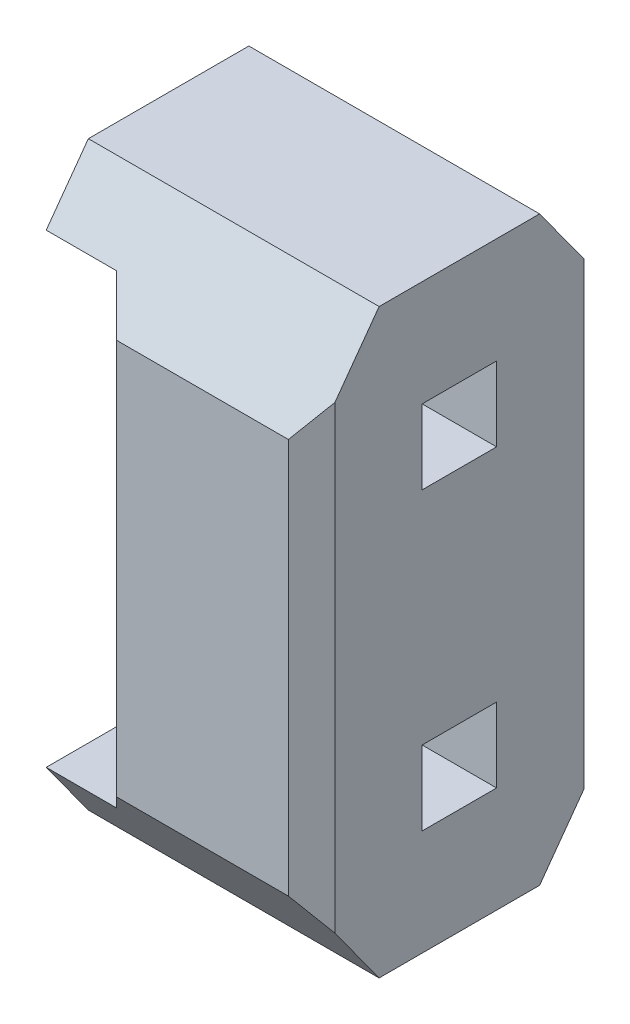
ISO-10303-21;
HEADER;
FILE_DESCRIPTION(('STEP AP214'),'2;1');
FILE_NAME('part.step','',(''),(''),'','','');
FILE_SCHEMA(('AUTOMOTIVE_DESIGN { 1 0 10303 214 1 1 1 1 }'));
ENDSEC;
DATA;
#1=APPLICATION_CONTEXT('core data for automotive mechanical design processes');
#2=APPLICATION_PROTOCOL_DEFINITION('international standard','automotive_design',2000,#1);
#3=PRODUCT_CONTEXT('',#1,'mechanical');
#4=PRODUCT('Part','Part','',(#3));
#5=PRODUCT_RELATED_PRODUCT_CATEGORY('part','',(#4));
#6=PRODUCT_DEFINITION_FORMATION('','',#4);
#7=PRODUCT_DEFINITION_CONTEXT('part definition',#1,'design');
#8=PRODUCT_DEFINITION('design','',#6,#7);
#9=PRODUCT_DEFINITION_SHAPE('','',#8);
#10=(LENGTH_UNIT() NAMED_UNIT(*) SI_UNIT(.MILLI.,.METRE.));
#11=(NAMED_UNIT(*) PLANE_ANGLE_UNIT() SI_UNIT($,.RADIAN.));
#12=(NAMED_UNIT(*) SI_UNIT($,.STERADIAN.) SOLID_ANGLE_UNIT());
#13=UNCERTAINTY_MEASURE_WITH_UNIT(LENGTH_MEASURE(1.E-05),#10,'distance_accuracy_value','');
#14=(GEOMETRIC_REPRESENTATION_CONTEXT(3) GLOBAL_UNCERTAINTY_ASSIGNED_CONTEXT((#13)) GLOBAL_UNIT_ASSIGNED_CONTEXT((#10,
#11,#12)) REPRESENTATION_CONTEXT('',''));
#15=CARTESIAN_POINT('',(0.,0.,0.));
#16=DIRECTION('',(0.,0.,1.));
#17=DIRECTION('',(1.,0.,0.));
#18=AXIS2_PLACEMENT_3D('',#15,#16,#17);
#19=CARTESIAN_POINT('',(1.25,4.6,-33.31));
#20=DIRECTION('',(0.,0.586967571460905,0.809610443394407));
#21=DIRECTION('',(0.,-0.809610443394407,0.586967571460905));
#22=AXIS2_PLACEMENT_3D('',#19,#20,#21);
#23=PLANE('',#22);
#24=DIRECTION('',(1.,0.,0.));
#25=VECTOR('',#24,1.);
#26=CARTESIAN_POINT('',(1.25,4.49999999999999,-33.2375));
#27=LINE('',#26,#25);
#28=CARTESIAN_POINT('',(0.,4.5,-33.2375));
#29=VERTEX_POINT('',#28);
#30=CARTESIAN_POINT('',(0.602500000000326,4.5,-33.2375000000001));
#31=VERTEX_POINT('',#30);
#32=EDGE_CURVE('E199',#29,#31,#27,.T.);
#33=ORIENTED_EDGE('',*,*,#32,.T.);
#34=DIRECTION('',(0.506207656348698,-0.698217457033983,0.506207656349602));
#35=VECTOR('',#34,1.);
#36=CARTESIAN_POINT('',(0.6025000000002,4.49999999999999,-33.2375));
#37=LINE('',#36,#35);
#38=CARTESIAN_POINT('',(0.819999999999672,4.19999999999999,-33.0199999999999));
#39=VERTEX_POINT('',#38);
#40=EDGE_CURVE('E197',#31,#39,#37,.T.);
#41=ORIENTED_EDGE('',*,*,#40,.T.);
#42=DIRECTION('',(1.,0.,0.));
#43=VECTOR('',#42,1.);
#44=CARTESIAN_POINT('',(1.25,4.19999999999999,-33.02));
#45=LINE('',#44,#43);
#46=CARTESIAN_POINT('',(2.30000000000012,4.19999999999999,-33.0199999999999));
#47=VERTEX_POINT('',#46);
#48=EDGE_CURVE('E20',#39,#47,#45,.T.);
#49=ORIENTED_EDGE('',*,*,#48,.T.);
#50=DIRECTION('',(0.506207656348956,0.698217457033859,-0.506207656349515));
#51=VECTOR('',#50,1.);
#52=CARTESIAN_POINT('',(2.3,4.19999999999999,-33.02));
#53=LINE('',#52,#51);
#54=CARTESIAN_POINT('',(2.49999999999988,4.47586206896591,-33.2200000000002));
#55=VERTEX_POINT('',#54);
#56=EDGE_CURVE('E181',#47,#55,#53,.T.);
#57=ORIENTED_EDGE('',*,*,#56,.T.);
#58=DIRECTION('',(0.,-0.809610443394407,0.586967571460905));
#59=VECTOR('',#58,1.);
#60=CARTESIAN_POINT('',(2.5,4.6,-33.31));
#61=LINE('',#60,#59);
#62=CARTESIAN_POINT('',(2.5,5.,-33.6));
#63=VERTEX_POINT('',#62);
#64=EDGE_CURVE('E188',#55,#63,#61,.F.);
#65=ORIENTED_EDGE('',*,*,#64,.T.);
#66=DIRECTION('',(1.,0.,0.));
#67=VECTOR('',#66,1.);
#68=CARTESIAN_POINT('',(1.25,5.,-33.6));
#69=LINE('',#68,#67);
#70=CARTESIAN_POINT('',(0.,5.,-33.6));
#71=VERTEX_POINT('',#70);
#72=EDGE_CURVE('E215',#71,#63,#69,.T.);
#73=ORIENTED_EDGE('',*,*,#72,.F.);
#74=DIRECTION('',(0.,-0.809610443394407,0.586967571460905));
#75=VECTOR('',#74,1.);
#76=CARTESIAN_POINT('',(0.,4.6,-33.31));
#77=LINE('',#76,#75);
#78=EDGE_CURVE('E207',#71,#29,#77,.T.);
#79=ORIENTED_EDGE('',*,*,#78,.T.);
#80=EDGE_LOOP('',(#33,#41,#49,#57,#65,#73,#79));
#81=FACE_BOUND('',#80,.T.);
#82=ADVANCED_FACE('F17',(#81),#23,.T.);
#83=CARTESIAN_POINT('',(1.25,4.6,-35.27));
#84=DIRECTION('',(0.,-0.586967571460905,0.809610443394407));
#85=DIRECTION('',(0.,-0.809610443394407,-0.586967571460905));
#86=AXIS2_PLACEMENT_3D('',#83,#84,#85);
#87=PLANE('',#86);
#88=DIRECTION('',(0.,-0.809610443394407,-0.586967571460905));
#89=VECTOR('',#88,1.);
#90=CARTESIAN_POINT('',(0.,4.6,-35.27));
#91=LINE('',#90,#89);
#92=CARTESIAN_POINT('',(0.,5.00000000000001,-34.98));
#93=VERTEX_POINT('',#92);
#94=CARTESIAN_POINT('',(0.,4.5,-35.3425));
#95=VERTEX_POINT('',#94);
#96=EDGE_CURVE('E263',#93,#95,#91,.T.);
#97=ORIENTED_EDGE('',*,*,#96,.F.);
#98=DIRECTION('',(1.,0.,0.));
#99=VECTOR('',#98,1.);
#100=CARTESIAN_POINT('',(1.25,5.,-34.98));
#101=LINE('',#100,#99);
#102=CARTESIAN_POINT('',(2.5,5.,-34.98));
#103=VERTEX_POINT('',#102);
#104=EDGE_CURVE('E227',#103,#93,#101,.F.);
#105=ORIENTED_EDGE('',*,*,#104,.F.);
#106=DIRECTION('',(0.,-0.809610443394407,-0.586967571460905));
#107=VECTOR('',#106,1.);
#108=CARTESIAN_POINT('',(2.5,4.6,-35.27));
#109=LINE('',#108,#107);
#110=CARTESIAN_POINT('',(2.49999999999988,4.47586206896592,-35.3599999999998));
#111=VERTEX_POINT('',#110);
#112=EDGE_CURVE('E223',#111,#103,#109,.F.);
#113=ORIENTED_EDGE('',*,*,#112,.F.);
#114=DIRECTION('',(0.506207656348957,0.698217457033858,0.506207656349515));
#115=VECTOR('',#114,1.);
#116=CARTESIAN_POINT('',(2.3,4.19999999999999,-35.56));
#117=LINE('',#116,#115);
#118=CARTESIAN_POINT('',(2.30000000000012,4.2,-35.5600000000001));
#119=VERTEX_POINT('',#118);
#120=EDGE_CURVE('E266',#119,#111,#117,.T.);
#121=ORIENTED_EDGE('',*,*,#120,.F.);
#122=DIRECTION('',(1.,0.,0.));
#123=VECTOR('',#122,1.);
#124=CARTESIAN_POINT('',(1.25,4.19999999999999,-35.56));
#125=LINE('',#124,#123);
#126=CARTESIAN_POINT('',(0.819999999999671,4.2,-35.5600000000001));
#127=VERTEX_POINT('',#126);
#128=EDGE_CURVE('E205',#127,#119,#125,.T.);
#129=ORIENTED_EDGE('',*,*,#128,.F.);
#130=DIRECTION('',(0.506207656348697,-0.698217457033984,-0.506207656349602));
#131=VECTOR('',#130,1.);
#132=CARTESIAN_POINT('',(0.6025000000002,4.5,-35.3425));
#133=LINE('',#132,#131);
#134=CARTESIAN_POINT('',(0.602500000000324,4.5,-35.3424999999999));
#135=VERTEX_POINT('',#134);
#136=EDGE_CURVE('E203',#135,#127,#133,.T.);
#137=ORIENTED_EDGE('',*,*,#136,.F.);
#138=DIRECTION('',(1.,0.,0.));
#139=VECTOR('',#138,1.);
#140=CARTESIAN_POINT('',(1.25,4.5,-35.3425));
#141=LINE('',#140,#139);
#142=EDGE_CURVE('E261',#95,#135,#141,.T.);
#143=ORIENTED_EDGE('',*,*,#142,.F.);
#144=EDGE_LOOP('',(#97,#105,#113,#121,#129,#137,#143));
#145=FACE_BOUND('',#144,.T.);
#146=ADVANCED_FACE('F285',(#145),#87,.F.);
#147=CARTESIAN_POINT('',(1.25,0.4,-35.27));
#148=DIRECTION('',(0.,0.586967571460905,0.809610443394407));
#149=DIRECTION('',(0.,-0.809610443394407,0.586967571460905));
#150=AXIS2_PLACEMENT_3D('',#147,#148,#149);
#151=PLANE('',#150);
#152=DIRECTION('',(-0.506207656349409,0.698217457033648,-0.506207656349353));
#153=VECTOR('',#152,1.);
#154=CARTESIAN_POINT('',(2.5,0.524137931034498,-35.36));
#155=LINE('',#154,#153);
#156=CARTESIAN_POINT('',(2.49999999999988,0.524137931034499,-35.3599999999999));
#157=VERTEX_POINT('',#156);
#158=CARTESIAN_POINT('',(2.30000000000012,0.800000000000004,-35.5600000000001));
#159=VERTEX_POINT('',#158);
#160=EDGE_CURVE('E251',#157,#159,#155,.T.);
#161=ORIENTED_EDGE('',*,*,#160,.F.);
#162=DIRECTION('',(0.,-0.809610443394407,0.586967571460905));
#163=VECTOR('',#162,1.);
#164=CARTESIAN_POINT('',(2.5,0.4,-35.27));
#165=LINE('',#164,#163);
#166=CARTESIAN_POINT('',(2.5,0.,-34.98));
#167=VERTEX_POINT('',#166);
#168=EDGE_CURVE('E253',#167,#157,#165,.F.);
#169=ORIENTED_EDGE('',*,*,#168,.F.);
#170=DIRECTION('',(1.,0.,0.));
#171=VECTOR('',#170,1.);
#172=CARTESIAN_POINT('',(1.25,0.,-34.98));
#173=LINE('',#172,#171);
#174=CARTESIAN_POINT('',(0.,0.,-34.98));
#175=VERTEX_POINT('',#174);
#176=EDGE_CURVE('E288',#167,#175,#173,.F.);
#177=ORIENTED_EDGE('',*,*,#176,.T.);
#178=DIRECTION('',(0.,-0.809610443394407,0.586967571460905));
#179=VECTOR('',#178,1.);
#180=CARTESIAN_POINT('',(0.,0.4,-35.27));
#181=LINE('',#180,#179);
#182=CARTESIAN_POINT('',(0.,0.5,-35.3425));
#183=VERTEX_POINT('',#182);
#184=EDGE_CURVE('E255',#183,#175,#181,.T.);
#185=ORIENTED_EDGE('',*,*,#184,.F.);
#186=DIRECTION('',(1.,0.,0.));
#187=VECTOR('',#186,1.);
#188=CARTESIAN_POINT('',(1.25,0.500000000000001,-35.3425));
#189=LINE('',#188,#187);
#190=CARTESIAN_POINT('',(0.602500000000324,0.5,-35.3424999999999));
#191=VERTEX_POINT('',#190);
#192=EDGE_CURVE('E257',#191,#183,#189,.F.);
#193=ORIENTED_EDGE('',*,*,#192,.F.);
#194=DIRECTION('',(-0.506207656348696,-0.698217457033985,0.506207656349601));
#195=VECTOR('',#194,1.);
#196=CARTESIAN_POINT('',(0.8199999999998,0.800000000000008,-35.56));
#197=LINE('',#196,#195);
#198=CARTESIAN_POINT('',(0.819999999999671,0.800000000000004,-35.5600000000001));
#199=VERTEX_POINT('',#198);
#200=EDGE_CURVE('E259',#199,#191,#197,.T.);
#201=ORIENTED_EDGE('',*,*,#200,.F.);
#202=DIRECTION('',(1.,0.,0.));
#203=VECTOR('',#202,1.);
#204=CARTESIAN_POINT('',(1.25,0.800000000000008,-35.56));
#205=LINE('',#204,#203);
#206=EDGE_CURVE('E249',#159,#199,#205,.F.);
#207=ORIENTED_EDGE('',*,*,#206,.F.);
#208=EDGE_LOOP('',(#161,#169,#177,#185,#193,#201,#207));
#209=FACE_BOUND('',#208,.T.);
#210=ADVANCED_FACE('F431',(#209),#151,.F.);
#211=CARTESIAN_POINT('',(1.25,0.4,-33.31));
#212=DIRECTION('',(0.,-0.586967571460905,0.809610443394407));
#213=DIRECTION('',(0.,-0.809610443394407,-0.586967571460905));
#214=AXIS2_PLACEMENT_3D('',#211,#212,#213);
#215=PLANE('',#214);
#216=DIRECTION('',(1.,0.,0.));
#217=VECTOR('',#216,1.);
#218=CARTESIAN_POINT('',(1.25,0.800000000000013,-33.02));
#219=LINE('',#218,#217);
#220=CARTESIAN_POINT('',(2.30000000000012,0.800000000000007,-33.0199999999999));
#221=VERTEX_POINT('',#220);
#222=CARTESIAN_POINT('',(0.819999999999672,0.800000000000007,-33.0199999999999));
#223=VERTEX_POINT('',#222);
#224=EDGE_CURVE('E191',#221,#223,#219,.F.);
#225=ORIENTED_EDGE('',*,*,#224,.T.);
#226=DIRECTION('',(-0.506207656348698,-0.698217457033982,-0.506207656349602));
#227=VECTOR('',#226,1.);
#228=CARTESIAN_POINT('',(0.8199999999998,0.800000000000013,-33.02));
#229=LINE('',#228,#227);
#230=CARTESIAN_POINT('',(0.602500000000326,0.500000000000004,-33.2375000000001));
#231=VERTEX_POINT('',#230);
#232=EDGE_CURVE('E232',#223,#231,#229,.T.);
#233=ORIENTED_EDGE('',*,*,#232,.T.);
#234=DIRECTION('',(1.,0.,0.));
#235=VECTOR('',#234,1.);
#236=CARTESIAN_POINT('',(1.25,0.500000000000009,-33.2375));
#237=LINE('',#236,#235);
#238=CARTESIAN_POINT('',(0.,0.500000000000005,-33.2375));
#239=VERTEX_POINT('',#238);
#240=EDGE_CURVE('E246',#231,#239,#237,.F.);
#241=ORIENTED_EDGE('',*,*,#240,.T.);
#242=DIRECTION('',(0.,-0.809610443394407,-0.586967571460905));
#243=VECTOR('',#242,1.);
#244=CARTESIAN_POINT('',(0.,0.4,-33.31));
#245=LINE('',#244,#243);
#246=CARTESIAN_POINT('',(0.,0.,-33.6));
#247=VERTEX_POINT('',#246);
#248=EDGE_CURVE('E244',#239,#247,#245,.T.);
#249=ORIENTED_EDGE('',*,*,#248,.T.);
#250=DIRECTION('',(1.,0.,0.));
#251=VECTOR('',#250,1.);
#252=CARTESIAN_POINT('',(1.25,0.,-33.6));
#253=LINE('',#252,#251);
#254=CARTESIAN_POINT('',(2.5,0.,-33.6));
#255=VERTEX_POINT('',#254);
#256=EDGE_CURVE('E293',#247,#255,#253,.T.);
#257=ORIENTED_EDGE('',*,*,#256,.T.);
#258=DIRECTION('',(0.,-0.809610443394407,-0.586967571460905));
#259=VECTOR('',#258,1.);
#260=CARTESIAN_POINT('',(2.5,0.4,-33.31));
#261=LINE('',#260,#259);
#262=CARTESIAN_POINT('',(2.49999999999988,0.5241379310345,-33.2200000000001));
#263=VERTEX_POINT('',#262);
#264=EDGE_CURVE('E241',#255,#263,#261,.F.);
#265=ORIENTED_EDGE('',*,*,#264,.T.);
#266=DIRECTION('',(-0.506207656349401,0.698217457033646,0.506207656349363));
#267=VECTOR('',#266,1.);
#268=CARTESIAN_POINT('',(2.5,0.5241379310345,-33.22));
#269=LINE('',#268,#267);
#270=EDGE_CURVE('E239',#263,#221,#269,.T.);
#271=ORIENTED_EDGE('',*,*,#270,.T.);
#272=EDGE_LOOP('',(#225,#233,#241,#249,#257,#265,#271));
#273=FACE_BOUND('',#272,.T.);
#274=ADVANCED_FACE('F421',(#273),#215,.T.);
#275=CARTESIAN_POINT('',(1.25,5.,-34.29));
#276=DIRECTION('',(0.,1.,0.));
#277=DIRECTION('',(0.,0.,1.));
#278=AXIS2_PLACEMENT_3D('',#275,#276,#277);
#279=PLANE('',#278);
#280=ORIENTED_EDGE('',*,*,#104,.T.);
#281=DIRECTION('',(0.,0.,-1.));
#282=VECTOR('',#281,1.);
#283=CARTESIAN_POINT('',(0.,5.,-34.29));
#284=LINE('',#283,#282);
#285=EDGE_CURVE('E231',#93,#71,#284,.F.);
#286=ORIENTED_EDGE('',*,*,#285,.T.);
#287=ORIENTED_EDGE('',*,*,#72,.T.);
#288=DIRECTION('',(0.,0.,1.));
#289=VECTOR('',#288,1.);
#290=CARTESIAN_POINT('',(2.5,5.,-34.29));
#291=LINE('',#290,#289);
#292=EDGE_CURVE('E219',#63,#103,#291,.F.);
#293=ORIENTED_EDGE('',*,*,#292,.T.);
#294=EDGE_LOOP('',(#280,#286,#287,#293));
#295=FACE_BOUND('',#294,.T.);
#296=ADVANCED_FACE('F229',(#295),#279,.T.);
#297=CARTESIAN_POINT('',(1.25,0.,-34.29));
#298=DIRECTION('',(0.,1.,0.));
#299=DIRECTION('',(0.,0.,1.));
#300=AXIS2_PLACEMENT_3D('',#297,#298,#299);
#301=PLANE('',#300);
#302=DIRECTION('',(0.,0.,-1.));
#303=VECTOR('',#302,1.);
#304=CARTESIAN_POINT('',(0.,0.,-34.29));
#305=LINE('',#304,#303);
#306=EDGE_CURVE('E297',#247,#175,#305,.T.);
#307=ORIENTED_EDGE('',*,*,#306,.T.);
#308=ORIENTED_EDGE('',*,*,#176,.F.);
#309=DIRECTION('',(0.,0.,1.));
#310=VECTOR('',#309,1.);
#311=CARTESIAN_POINT('',(2.5,0.,-34.29));
#312=LINE('',#311,#310);
#313=EDGE_CURVE('E287',#255,#167,#312,.F.);
#314=ORIENTED_EDGE('',*,*,#313,.F.);
#315=ORIENTED_EDGE('',*,*,#256,.F.);
#316=EDGE_LOOP('',(#307,#308,#314,#315));
#317=FACE_BOUND('',#316,.T.);
#318=ADVANCED_FACE('F428',(#317),#301,.F.);
#319=CARTESIAN_POINT('',(0.,4.75,-34.29));
#320=DIRECTION('',(1.,0.,0.));
#321=DIRECTION('',(0.,0.,-1.));
#322=AXIS2_PLACEMENT_3D('',#319,#320,#321);
#323=PLANE('',#322);
#324=ORIENTED_EDGE('',*,*,#285,.F.);
#325=ORIENTED_EDGE('',*,*,#96,.T.);
#326=DIRECTION('',(0.,0.,1.));
#327=VECTOR('',#326,1.);
#328=CARTESIAN_POINT('',(0.,4.5,-34.29));
#329=LINE('',#328,#327);
#330=EDGE_CURVE('E307',#95,#29,#329,.T.);
#331=ORIENTED_EDGE('',*,*,#330,.T.);
#332=ORIENTED_EDGE('',*,*,#78,.F.);
#333=EDGE_LOOP('',(#324,#325,#331,#332));
#334=FACE_BOUND('',#333,.T.);
#335=ADVANCED_FACE('F441',(#334),#323,.F.);
#336=CARTESIAN_POINT('',(0.,0.25,-34.29));
#337=DIRECTION('',(1.,0.,0.));
#338=DIRECTION('',(0.,0.,-1.));
#339=AXIS2_PLACEMENT_3D('',#336,#337,#338);
#340=PLANE('',#339);
#341=ORIENTED_EDGE('',*,*,#306,.F.);
#342=ORIENTED_EDGE('',*,*,#248,.F.);
#343=DIRECTION('',(0.,0.,1.));
#344=VECTOR('',#343,1.);
#345=CARTESIAN_POINT('',(0.,0.5,-34.29));
#346=LINE('',#345,#344);
#347=EDGE_CURVE('E315',#183,#239,#346,.T.);
#348=ORIENTED_EDGE('',*,*,#347,.F.);
#349=ORIENTED_EDGE('',*,*,#184,.T.);
#350=EDGE_LOOP('',(#341,#342,#348,#349));
#351=FACE_BOUND('',#350,.T.);
#352=ADVANCED_FACE('F443',(#351),#340,.F.);
#353=CARTESIAN_POINT('',(1.55,3.45,-34.29));
#354=DIRECTION('',(0.,1.,0.));
#355=DIRECTION('',(0.,0.,1.));
#356=AXIS2_PLACEMENT_3D('',#353,#354,#355);
#357=PLANE('',#356);
#358=DIRECTION('',(1.,0.,0.));
#359=VECTOR('',#358,1.);
#360=CARTESIAN_POINT('',(1.55,3.45,-34.61));
#361=LINE('',#360,#359);
#362=CARTESIAN_POINT('',(0.6,3.45,-34.61));
#363=VERTEX_POINT('',#362);
#364=CARTESIAN_POINT('',(2.5,3.45,-34.61));
#365=VERTEX_POINT('',#364);
#366=EDGE_CURVE('E332',#363,#365,#361,.T.);
#367=ORIENTED_EDGE('',*,*,#366,.F.);
#368=DIRECTION('',(0.,0.,1.));
#369=VECTOR('',#368,1.);
#370=CARTESIAN_POINT('',(0.6,3.45,-34.29));
#371=LINE('',#370,#369);
#372=CARTESIAN_POINT('',(0.6,3.45,-33.97));
#373=VERTEX_POINT('',#372);
#374=EDGE_CURVE('E302',#363,#373,#371,.T.);
#375=ORIENTED_EDGE('',*,*,#374,.T.);
#376=DIRECTION('',(1.,0.,0.));
#377=VECTOR('',#376,1.);
#378=CARTESIAN_POINT('',(1.55,3.45,-33.97));
#379=LINE('',#378,#377);
#380=CARTESIAN_POINT('',(2.5,3.45,-33.97));
#381=VERTEX_POINT('',#380);
#382=EDGE_CURVE('E327',#373,#381,#379,.T.);
#383=ORIENTED_EDGE('',*,*,#382,.T.);
#384=DIRECTION('',(0.,0.,1.));
#385=VECTOR('',#384,1.);
#386=CARTESIAN_POINT('',(2.5,3.45,-34.29));
#387=LINE('',#386,#385);
#388=EDGE_CURVE('E300',#381,#365,#387,.F.);
#389=ORIENTED_EDGE('',*,*,#388,.T.);
#390=EDGE_LOOP('',(#367,#375,#383,#389));
#391=FACE_BOUND('',#390,.T.);
#392=ADVANCED_FACE('F398',(#391),#357,.T.);
#393=CARTESIAN_POINT('',(0.71,2.5,-35.45));
#394=DIRECTION('',(0.707106781190498,0.,0.707106781182598));
#395=DIRECTION('',(0.707106781182598,0.,-0.707106781190498));
#396=AXIS2_PLACEMENT_3D('',#393,#394,#395);
#397=PLANE('',#396);
#398=ORIENTED_EDGE('',*,*,#200,.T.);
#399=DIRECTION('',(0.707106781187161,0.,-0.707106781185934));
#400=VECTOR('',#399,1.);
#401=CARTESIAN_POINT('',(0.6000000000002,0.5,-35.34));
#402=LINE('',#401,#400);
#403=CARTESIAN_POINT('',(0.600000000000408,0.5,-35.3399999999997));
#404=VERTEX_POINT('',#403);
#405=EDGE_CURVE('E312',#404,#191,#402,.T.);
#406=ORIENTED_EDGE('',*,*,#405,.F.);
#407=DIRECTION('',(0.,1.,0.));
#408=VECTOR('',#407,1.);
#409=CARTESIAN_POINT('',(0.6,2.5,-35.34));
#410=LINE('',#409,#408);
#411=CARTESIAN_POINT('',(0.600000000000408,4.5,-35.3399999999997));
#412=VERTEX_POINT('',#411);
#413=EDGE_CURVE('E337',#404,#412,#410,.T.);
#414=ORIENTED_EDGE('',*,*,#413,.T.);
#415=DIRECTION('',(0.707106781187161,0.,-0.707106781185934));
#416=VECTOR('',#415,1.);
#417=CARTESIAN_POINT('',(0.6000000000002,4.5,-35.34));
#418=LINE('',#417,#416);
#419=EDGE_CURVE('E304',#412,#135,#418,.T.);
#420=ORIENTED_EDGE('',*,*,#419,.T.);
#421=ORIENTED_EDGE('',*,*,#136,.T.);
#422=DIRECTION('',(0.,1.,0.));
#423=VECTOR('',#422,1.);
#424=CARTESIAN_POINT('',(0.8199999999998,2.5,-35.56));
#425=LINE('',#424,#423);
#426=EDGE_CURVE('E275',#127,#199,#425,.F.);
#427=ORIENTED_EDGE('',*,*,#426,.T.);
#428=EDGE_LOOP('',(#398,#406,#414,#420,#421,#427));
#429=FACE_BOUND('',#428,.T.);
#430=ADVANCED_FACE('F435',(#429),#397,.F.);
#431=CARTESIAN_POINT('',(0.30125,4.5,-34.29));
#432=DIRECTION('',(0.,1.,0.));
#433=DIRECTION('',(0.,0.,1.));
#434=AXIS2_PLACEMENT_3D('',#431,#432,#433);
#435=PLANE('',#434);
#436=ORIENTED_EDGE('',*,*,#142,.T.);
#437=ORIENTED_EDGE('',*,*,#419,.F.);
#438=DIRECTION('',(0.,0.,-1.));
#439=VECTOR('',#438,1.);
#440=CARTESIAN_POINT('',(0.6,4.5,-34.29));
#441=LINE('',#440,#439);
#442=CARTESIAN_POINT('',(0.600000000000279,4.5,-33.2400000000001));
#443=VERTEX_POINT('',#442);
#444=EDGE_CURVE('E339',#412,#443,#441,.F.);
#445=ORIENTED_EDGE('',*,*,#444,.T.);
#446=DIRECTION('',(-0.707106781182598,0.,-0.707106781190498));
#447=VECTOR('',#446,1.);
#448=CARTESIAN_POINT('',(0.71,4.5,-33.13));
#449=LINE('',#448,#447);
#450=EDGE_CURVE('E310',#443,#31,#449,.F.);
#451=ORIENTED_EDGE('',*,*,#450,.T.);
#452=ORIENTED_EDGE('',*,*,#32,.F.);
#453=ORIENTED_EDGE('',*,*,#330,.F.);
#454=EDGE_LOOP('',(#436,#437,#445,#451,#452,#453));
#455=FACE_BOUND('',#454,.T.);
#456=ADVANCED_FACE('F439',(#455),#435,.F.);
#457=CARTESIAN_POINT('',(0.71,2.5,-33.13));
#458=DIRECTION('',(0.707106781190498,0.,-0.707106781182598));
#459=DIRECTION('',(-0.707106781182598,0.,-0.707106781190498));
#460=AXIS2_PLACEMENT_3D('',#457,#458,#459);
#461=PLANE('',#460);
#462=ORIENTED_EDGE('',*,*,#232,.F.);
#463=DIRECTION('',(0.,1.,0.));
#464=VECTOR('',#463,1.);
#465=CARTESIAN_POINT('',(0.8199999999998,2.5,-33.02));
#466=LINE('',#465,#464);
#467=EDGE_CURVE('E325',#39,#223,#466,.F.);
#468=ORIENTED_EDGE('',*,*,#467,.F.);
#469=ORIENTED_EDGE('',*,*,#40,.F.);
#470=ORIENTED_EDGE('',*,*,#450,.F.);
#471=DIRECTION('',(0.,1.,0.));
#472=VECTOR('',#471,1.);
#473=CARTESIAN_POINT('',(0.6,2.5,-33.24));
#474=LINE('',#473,#472);
#475=CARTESIAN_POINT('',(0.600000000000408,0.5,-33.2400000000003));
#476=VERTEX_POINT('',#475);
#477=EDGE_CURVE('E341',#443,#476,#474,.F.);
#478=ORIENTED_EDGE('',*,*,#477,.T.);
#479=DIRECTION('',(-0.707106781185198,0.,-0.707106781187897));
#480=VECTOR('',#479,1.);
#481=CARTESIAN_POINT('',(0.6025000000002,0.5,-33.2375));
#482=LINE('',#481,#480);
#483=EDGE_CURVE('E318',#231,#476,#482,.T.);
#484=ORIENTED_EDGE('',*,*,#483,.F.);
#485=EDGE_LOOP('',(#462,#468,#469,#470,#478,#484));
#486=FACE_BOUND('',#485,.T.);
#487=ADVANCED_FACE('F416',(#486),#461,.F.);
#488=CARTESIAN_POINT('',(0.30125,0.5,-34.29));
#489=DIRECTION('',(0.,1.,0.));
#490=DIRECTION('',(0.,0.,1.));
#491=AXIS2_PLACEMENT_3D('',#488,#489,#490);
#492=PLANE('',#491);
#493=ORIENTED_EDGE('',*,*,#483,.T.);
#494=DIRECTION('',(0.,0.,-1.));
#495=VECTOR('',#494,1.);
#496=CARTESIAN_POINT('',(0.6,0.5,-34.29));
#497=LINE('',#496,#495);
#498=EDGE_CURVE('E343',#476,#404,#497,.T.);
#499=ORIENTED_EDGE('',*,*,#498,.T.);
#500=ORIENTED_EDGE('',*,*,#405,.T.);
#501=ORIENTED_EDGE('',*,*,#192,.T.);
#502=ORIENTED_EDGE('',*,*,#347,.T.);
#503=ORIENTED_EDGE('',*,*,#240,.F.);
#504=EDGE_LOOP('',(#493,#499,#500,#501,#502,#503));
#505=FACE_BOUND('',#504,.T.);
#506=ADVANCED_FACE('F418',(#505),#492,.T.);
#507=CARTESIAN_POINT('',(1.55,1.23,-34.61));
#508=DIRECTION('',(0.,0.,1.));
#509=DIRECTION('',(1.,0.,0.));
#510=AXIS2_PLACEMENT_3D('',#507,#508,#509);
#511=PLANE('',#510);
#512=DIRECTION('',(1.,0.,0.));
#513=VECTOR('',#512,1.);
#514=CARTESIAN_POINT('',(1.55,1.55,-34.61));
#515=LINE('',#514,#513);
#516=CARTESIAN_POINT('',(2.5,1.55,-34.61));
#517=VERTEX_POINT('',#516);
#518=CARTESIAN_POINT('',(0.6,1.55,-34.61));
#519=VERTEX_POINT('',#518);
#520=EDGE_CURVE('E283',#517,#519,#515,.F.);
#521=ORIENTED_EDGE('',*,*,#520,.T.);
#522=DIRECTION('',(0.,1.,0.));
#523=VECTOR('',#522,1.);
#524=CARTESIAN_POINT('',(0.6,2.5,-34.61));
#525=LINE('',#524,#523);
#526=CARTESIAN_POINT('',(0.6,0.91,-34.61));
#527=VERTEX_POINT('',#526);
#528=EDGE_CURVE('E346',#519,#527,#525,.F.);
#529=ORIENTED_EDGE('',*,*,#528,.T.);
#530=DIRECTION('',(1.,0.,0.));
#531=VECTOR('',#530,1.);
#532=CARTESIAN_POINT('',(1.55,0.91,-34.61));
#533=LINE('',#532,#531);
#534=CARTESIAN_POINT('',(2.5,0.91,-34.61));
#535=VERTEX_POINT('',#534);
#536=EDGE_CURVE('E354',#535,#527,#533,.F.);
#537=ORIENTED_EDGE('',*,*,#536,.F.);
#538=DIRECTION('',(0.,1.,0.));
#539=VECTOR('',#538,1.);
#540=CARTESIAN_POINT('',(2.5,1.23,-34.61));
#541=LINE('',#540,#539);
#542=EDGE_CURVE('E321',#535,#517,#541,.T.);
#543=ORIENTED_EDGE('',*,*,#542,.T.);
#544=EDGE_LOOP('',(#521,#529,#537,#543));
#545=FACE_BOUND('',#544,.T.);
#546=ADVANCED_FACE('F483',(#545),#511,.T.);
#547=CARTESIAN_POINT('',(1.56,2.5,-35.56));
#548=DIRECTION('',(0.,0.,1.));
#549=DIRECTION('',(1.,0.,0.));
#550=AXIS2_PLACEMENT_3D('',#547,#548,#549);
#551=PLANE('',#550);
#552=DIRECTION('',(0.,1.,0.));
#553=VECTOR('',#552,1.);
#554=CARTESIAN_POINT('',(2.30000000000047,2.5,-35.5600000000005));
#555=LINE('',#554,#553);
#556=EDGE_CURVE('E193',#159,#119,#555,.T.);
#557=ORIENTED_EDGE('',*,*,#556,.F.);
#558=ORIENTED_EDGE('',*,*,#206,.T.);
#559=ORIENTED_EDGE('',*,*,#426,.F.);
#560=ORIENTED_EDGE('',*,*,#128,.T.);
#561=EDGE_LOOP('',(#557,#558,#559,#560));
#562=FACE_BOUND('',#561,.T.);
#563=ADVANCED_FACE('F272',(#562),#551,.F.);
#564=CARTESIAN_POINT('',(1.56,2.5,-33.02));
#565=DIRECTION('',(0.,0.,1.));
#566=DIRECTION('',(1.,0.,0.));
#567=AXIS2_PLACEMENT_3D('',#564,#565,#566);
#568=PLANE('',#567);
#569=ORIENTED_EDGE('',*,*,#48,.F.);
#570=ORIENTED_EDGE('',*,*,#467,.T.);
#571=ORIENTED_EDGE('',*,*,#224,.F.);
#572=DIRECTION('',(0.,1.,0.));
#573=VECTOR('',#572,1.);
#574=CARTESIAN_POINT('',(2.30000000000047,2.5,-33.0199999999995));
#575=LINE('',#574,#573);
#576=EDGE_CURVE('E183',#47,#221,#575,.F.);
#577=ORIENTED_EDGE('',*,*,#576,.F.);
#578=EDGE_LOOP('',(#569,#570,#571,#577));
#579=FACE_BOUND('',#578,.T.);
#580=ADVANCED_FACE('F189',(#579),#568,.T.);
#581=CARTESIAN_POINT('',(1.55,3.77,-33.97));
#582=DIRECTION('',(0.,0.,1.));
#583=DIRECTION('',(1.,0.,0.));
#584=AXIS2_PLACEMENT_3D('',#581,#582,#583);
#585=PLANE('',#584);
#586=DIRECTION('',(0.,1.,0.));
#587=VECTOR('',#586,1.);
#588=CARTESIAN_POINT('',(2.5,3.77,-33.97));
#589=LINE('',#588,#587);
#590=CARTESIAN_POINT('',(2.5,4.09,-33.97));
#591=VERTEX_POINT('',#590);
#592=EDGE_CURVE('E330',#381,#591,#589,.T.);
#593=ORIENTED_EDGE('',*,*,#592,.F.);
#594=ORIENTED_EDGE('',*,*,#382,.F.);
#595=DIRECTION('',(0.,1.,0.));
#596=VECTOR('',#595,1.);
#597=CARTESIAN_POINT('',(0.6,2.5,-33.97));
#598=LINE('',#597,#596);
#599=CARTESIAN_POINT('',(0.6,4.09,-33.97));
#600=VERTEX_POINT('',#599);
#601=EDGE_CURVE('E351',#373,#600,#598,.T.);
#602=ORIENTED_EDGE('',*,*,#601,.T.);
#603=DIRECTION('',(1.,0.,0.));
#604=VECTOR('',#603,1.);
#605=CARTESIAN_POINT('',(1.55,4.09,-33.97));
#606=LINE('',#605,#604);
#607=EDGE_CURVE('E368',#600,#591,#606,.T.);
#608=ORIENTED_EDGE('',*,*,#607,.T.);
#609=EDGE_LOOP('',(#593,#594,#602,#608));
#610=FACE_BOUND('',#609,.T.);
#611=ADVANCED_FACE('F402',(#610),#585,.F.);
#612=CARTESIAN_POINT('',(1.55,3.77,-34.61));
#613=DIRECTION('',(0.,0.,1.));
#614=DIRECTION('',(1.,0.,0.));
#615=AXIS2_PLACEMENT_3D('',#612,#613,#614);
#616=PLANE('',#615);
#617=DIRECTION('',(1.,0.,0.));
#618=VECTOR('',#617,1.);
#619=CARTESIAN_POINT('',(1.55,4.09,-34.61));
#620=LINE('',#619,#618);
#621=CARTESIAN_POINT('',(2.5,4.09,-34.61));
#622=VERTEX_POINT('',#621);
#623=CARTESIAN_POINT('',(0.6,4.09,-34.61));
#624=VERTEX_POINT('',#623);
#625=EDGE_CURVE('E371',#622,#624,#620,.F.);
#626=ORIENTED_EDGE('',*,*,#625,.T.);
#627=DIRECTION('',(0.,1.,0.));
#628=VECTOR('',#627,1.);
#629=CARTESIAN_POINT('',(0.6,2.5,-34.61));
#630=LINE('',#629,#628);
#631=EDGE_CURVE('E348',#624,#363,#630,.F.);
#632=ORIENTED_EDGE('',*,*,#631,.T.);
#633=ORIENTED_EDGE('',*,*,#366,.T.);
#634=DIRECTION('',(0.,1.,0.));
#635=VECTOR('',#634,1.);
#636=CARTESIAN_POINT('',(2.5,3.77,-34.61));
#637=LINE('',#636,#635);
#638=EDGE_CURVE('E335',#365,#622,#637,.T.);
#639=ORIENTED_EDGE('',*,*,#638,.T.);
#640=EDGE_LOOP('',(#626,#632,#633,#639));
#641=FACE_BOUND('',#640,.T.);
#642=ADVANCED_FACE('F395',(#641),#616,.T.);
#643=CARTESIAN_POINT('',(0.6,2.5,-34.29));
#644=DIRECTION('',(1.,0.,0.));
#645=DIRECTION('',(0.,0.,-1.));
#646=AXIS2_PLACEMENT_3D('',#643,#644,#645);
#647=PLANE('',#646);
#648=ORIENTED_EDGE('',*,*,#374,.F.);
#649=ORIENTED_EDGE('',*,*,#631,.F.);
#650=DIRECTION('',(0.,0.,1.));
#651=VECTOR('',#650,1.);
#652=CARTESIAN_POINT('',(0.6,4.09,-34.29));
#653=LINE('',#652,#651);
#654=EDGE_CURVE('E192',#624,#600,#653,.T.);
#655=ORIENTED_EDGE('',*,*,#654,.T.);
#656=ORIENTED_EDGE('',*,*,#601,.F.);
#657=EDGE_LOOP('',(#648,#649,#655,#656));
#658=FACE_BOUND('',#657,.T.);
#659=ORIENTED_EDGE('',*,*,#528,.F.);
#660=DIRECTION('',(0.,0.,1.));
#661=VECTOR('',#660,1.);
#662=CARTESIAN_POINT('',(0.6,1.55,-34.29));
#663=LINE('',#662,#661);
#664=CARTESIAN_POINT('',(0.6,1.55,-33.97));
#665=VERTEX_POINT('',#664);
#666=EDGE_CURVE('E360',#519,#665,#663,.T.);
#667=ORIENTED_EDGE('',*,*,#666,.T.);
#668=DIRECTION('',(0.,1.,0.));
#669=VECTOR('',#668,1.);
#670=CARTESIAN_POINT('',(0.6,1.23,-33.97));
#671=LINE('',#670,#669);
#672=CARTESIAN_POINT('',(0.6,0.91,-33.97));
#673=VERTEX_POINT('',#672);
#674=EDGE_CURVE('E374',#665,#673,#671,.F.);
#675=ORIENTED_EDGE('',*,*,#674,.T.);
#676=DIRECTION('',(0.,0.,1.));
#677=VECTOR('',#676,1.);
#678=CARTESIAN_POINT('',(0.6,0.91,-34.29));
#679=LINE('',#678,#677);
#680=EDGE_CURVE('E357',#527,#673,#679,.T.);
#681=ORIENTED_EDGE('',*,*,#680,.F.);
#682=EDGE_LOOP('',(#659,#667,#675,#681));
#683=FACE_BOUND('',#682,.T.);
#684=ORIENTED_EDGE('',*,*,#477,.F.);
#685=ORIENTED_EDGE('',*,*,#444,.F.);
#686=ORIENTED_EDGE('',*,*,#413,.F.);
#687=ORIENTED_EDGE('',*,*,#498,.F.);
#688=EDGE_LOOP('',(#684,#685,#686,#687));
#689=FACE_BOUND('',#688,.T.);
#690=ADVANCED_FACE('F404',(#658,#683,#689),#647,.F.);
#691=CARTESIAN_POINT('',(1.55,0.91,-34.29));
#692=DIRECTION('',(0.,1.,0.));
#693=DIRECTION('',(0.,0.,1.));
#694=AXIS2_PLACEMENT_3D('',#691,#692,#693);
#695=PLANE('',#694);
#696=ORIENTED_EDGE('',*,*,#536,.T.);
#697=ORIENTED_EDGE('',*,*,#680,.T.);
#698=DIRECTION('',(1.,0.,0.));
#699=VECTOR('',#698,1.);
#700=CARTESIAN_POINT('',(1.55,0.91,-33.97));
#701=LINE('',#700,#699);
#702=CARTESIAN_POINT('',(2.5,0.91,-33.97));
#703=VERTEX_POINT('',#702);
#704=EDGE_CURVE('E376',#673,#703,#701,.T.);
#705=ORIENTED_EDGE('',*,*,#704,.T.);
#706=DIRECTION('',(0.,0.,1.));
#707=VECTOR('',#706,1.);
#708=CARTESIAN_POINT('',(2.5,0.91,-34.29));
#709=LINE('',#708,#707);
#710=EDGE_CURVE('E34',#703,#535,#709,.F.);
#711=ORIENTED_EDGE('',*,*,#710,.T.);
#712=EDGE_LOOP('',(#696,#697,#705,#711));
#713=FACE_BOUND('',#712,.T.);
#714=ADVANCED_FACE('F407',(#713),#695,.T.);
#715=CARTESIAN_POINT('',(1.55,1.55,-34.29));
#716=DIRECTION('',(0.,1.,0.));
#717=DIRECTION('',(0.,0.,1.));
#718=AXIS2_PLACEMENT_3D('',#715,#716,#717);
#719=PLANE('',#718);
#720=DIRECTION('',(0.,0.,1.));
#721=VECTOR('',#720,1.);
#722=CARTESIAN_POINT('',(2.5,1.55,-34.29));
#723=LINE('',#722,#721);
#724=CARTESIAN_POINT('',(2.5,1.55,-33.97));
#725=VERTEX_POINT('',#724);
#726=EDGE_CURVE('E362',#725,#517,#723,.F.);
#727=ORIENTED_EDGE('',*,*,#726,.F.);
#728=DIRECTION('',(1.,0.,0.));
#729=VECTOR('',#728,1.);
#730=CARTESIAN_POINT('',(1.55,1.55,-33.97));
#731=LINE('',#730,#729);
#732=EDGE_CURVE('E378',#725,#665,#731,.F.);
#733=ORIENTED_EDGE('',*,*,#732,.T.);
#734=ORIENTED_EDGE('',*,*,#666,.F.);
#735=ORIENTED_EDGE('',*,*,#520,.F.);
#736=EDGE_LOOP('',(#727,#733,#734,#735));
#737=FACE_BOUND('',#736,.T.);
#738=ADVANCED_FACE('F468',(#737),#719,.F.);
#739=CARTESIAN_POINT('',(2.4,2.5,-35.46));
#740=DIRECTION('',(0.707106781189898,0.,-0.707106781183198));
#741=DIRECTION('',(-0.707106781183198,0.,-0.707106781189898));
#742=AXIS2_PLACEMENT_3D('',#739,#740,#741);
#743=PLANE('',#742);
#744=DIRECTION('',(0.,1.,0.));
#745=VECTOR('',#744,1.);
#746=CARTESIAN_POINT('',(2.5,2.5,-35.36));
#747=LINE('',#746,#745);
#748=EDGE_CURVE('E381',#157,#111,#747,.T.);
#749=ORIENTED_EDGE('',*,*,#748,.F.);
#750=ORIENTED_EDGE('',*,*,#160,.T.);
#751=ORIENTED_EDGE('',*,*,#556,.T.);
#752=ORIENTED_EDGE('',*,*,#120,.T.);
#753=EDGE_LOOP('',(#749,#750,#751,#752));
#754=FACE_BOUND('',#753,.T.);
#755=ADVANCED_FACE('F281',(#754),#743,.T.);
#756=CARTESIAN_POINT('',(2.4,2.5,-33.12));
#757=DIRECTION('',(0.707106781189898,0.,0.707106781183198));
#758=DIRECTION('',(0.707106781183198,0.,-0.707106781189898));
#759=AXIS2_PLACEMENT_3D('',#756,#757,#758);
#760=PLANE('',#759);
#761=DIRECTION('',(0.,1.,0.));
#762=VECTOR('',#761,1.);
#763=CARTESIAN_POINT('',(2.5,2.5,-33.22));
#764=LINE('',#763,#762);
#765=EDGE_CURVE('E186',#55,#263,#764,.F.);
#766=ORIENTED_EDGE('',*,*,#765,.F.);
#767=ORIENTED_EDGE('',*,*,#56,.F.);
#768=ORIENTED_EDGE('',*,*,#576,.T.);
#769=ORIENTED_EDGE('',*,*,#270,.F.);
#770=EDGE_LOOP('',(#766,#767,#768,#769));
#771=FACE_BOUND('',#770,.T.);
#772=ADVANCED_FACE('F182',(#771),#760,.T.);
#773=CARTESIAN_POINT('',(1.55,4.09,-34.29));
#774=DIRECTION('',(0.,1.,0.));
#775=DIRECTION('',(0.,0.,1.));
#776=AXIS2_PLACEMENT_3D('',#773,#774,#775);
#777=PLANE('',#776);
#778=DIRECTION('',(0.,0.,-1.));
#779=VECTOR('',#778,1.);
#780=CARTESIAN_POINT('',(2.5,4.09,-34.29));
#781=LINE('',#780,#779);
#782=EDGE_CURVE('E26',#591,#622,#781,.T.);
#783=ORIENTED_EDGE('',*,*,#782,.F.);
#784=ORIENTED_EDGE('',*,*,#607,.F.);
#785=ORIENTED_EDGE('',*,*,#654,.F.);
#786=ORIENTED_EDGE('',*,*,#625,.F.);
#787=EDGE_LOOP('',(#783,#784,#785,#786));
#788=FACE_BOUND('',#787,.T.);
#789=ADVANCED_FACE('F392',(#788),#777,.F.);
#790=CARTESIAN_POINT('',(1.55,1.23,-33.97));
#791=DIRECTION('',(0.,0.,1.));
#792=DIRECTION('',(1.,0.,0.));
#793=AXIS2_PLACEMENT_3D('',#790,#791,#792);
#794=PLANE('',#793);
#795=DIRECTION('',(0.,1.,0.));
#796=VECTOR('',#795,1.);
#797=CARTESIAN_POINT('',(2.5,2.5,-33.97));
#798=LINE('',#797,#796);
#799=EDGE_CURVE('E11',#703,#725,#798,.T.);
#800=ORIENTED_EDGE('',*,*,#799,.F.);
#801=ORIENTED_EDGE('',*,*,#704,.F.);
#802=ORIENTED_EDGE('',*,*,#674,.F.);
#803=ORIENTED_EDGE('',*,*,#732,.F.);
#804=EDGE_LOOP('',(#800,#801,#802,#803));
#805=FACE_BOUND('',#804,.T.);
#806=ADVANCED_FACE('F454',(#805),#794,.F.);
#807=CARTESIAN_POINT('',(2.5,2.5,-34.29));
#808=DIRECTION('',(1.,0.,0.));
#809=DIRECTION('',(0.,0.,-1.));
#810=AXIS2_PLACEMENT_3D('',#807,#808,#809);
#811=PLANE('',#810);
#812=ORIENTED_EDGE('',*,*,#710,.F.);
#813=ORIENTED_EDGE('',*,*,#799,.T.);
#814=ORIENTED_EDGE('',*,*,#726,.T.);
#815=ORIENTED_EDGE('',*,*,#542,.F.);
#816=EDGE_LOOP('',(#812,#813,#814,#815));
#817=FACE_BOUND('',#816,.T.);
#818=ORIENTED_EDGE('',*,*,#592,.T.);
#819=ORIENTED_EDGE('',*,*,#782,.T.);
#820=ORIENTED_EDGE('',*,*,#638,.F.);
#821=ORIENTED_EDGE('',*,*,#388,.F.);
#822=EDGE_LOOP('',(#818,#819,#820,#821));
#823=FACE_BOUND('',#822,.T.);
#824=ORIENTED_EDGE('',*,*,#64,.F.);
#825=ORIENTED_EDGE('',*,*,#765,.T.);
#826=ORIENTED_EDGE('',*,*,#264,.F.);
#827=ORIENTED_EDGE('',*,*,#313,.T.);
#828=ORIENTED_EDGE('',*,*,#168,.T.);
#829=ORIENTED_EDGE('',*,*,#748,.T.);
#830=ORIENTED_EDGE('',*,*,#112,.T.);
#831=ORIENTED_EDGE('',*,*,#292,.F.);
#832=EDGE_LOOP('',(#824,#825,#826,#827,#828,#829,#830,#831));
#833=FACE_BOUND('',#832,.T.);
#834=ADVANCED_FACE('F220',(#817,#823,#833),#811,.T.);
#835=CLOSED_SHELL('',(#82,#146,#210,#274,#296,#318,#335,#352,#392,#430,#456,#487,#506,#546,#563,
#580,#611,#642,#690,#714,#738,#755,#772,#789,#806,#834));
#836=MANIFOLD_SOLID_BREP('B1',#835);
#837=ADVANCED_BREP_SHAPE_REPRESENTATION('',(#18,#836),#14);
#838=SHAPE_DEFINITION_REPRESENTATION(#9,#837);
ENDSEC;
END-ISO-10303-21;
